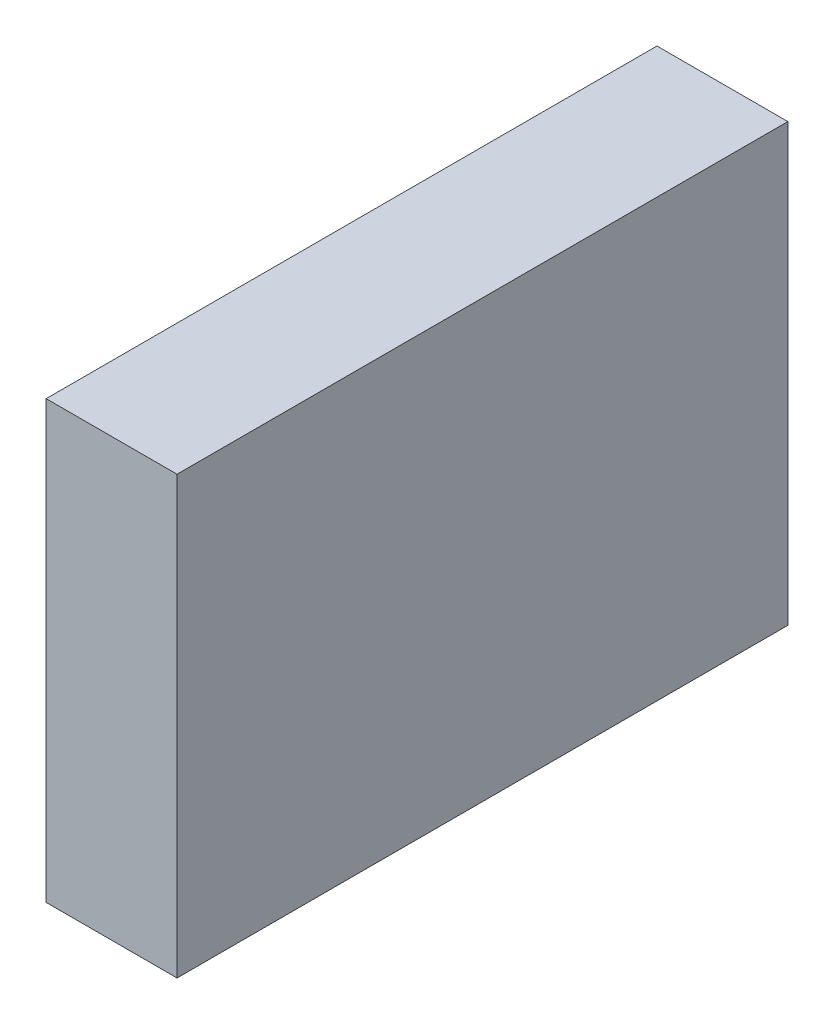
ISO-10303-21;
HEADER;
FILE_DESCRIPTION(('STEP AP214'),'2;1');
FILE_NAME('part.step','',(''),(''),'','','');
FILE_SCHEMA(('AUTOMOTIVE_DESIGN { 1 0 10303 214 1 1 1 1 }'));
ENDSEC;
DATA;
#1=APPLICATION_CONTEXT('core data for automotive mechanical design processes');
#2=APPLICATION_PROTOCOL_DEFINITION('international standard','automotive_design',2000,#1);
#3=PRODUCT_CONTEXT('',#1,'mechanical');
#4=PRODUCT('Part','Part','',(#3));
#5=PRODUCT_RELATED_PRODUCT_CATEGORY('part','',(#4));
#6=PRODUCT_DEFINITION_FORMATION('','',#4);
#7=PRODUCT_DEFINITION_CONTEXT('part definition',#1,'design');
#8=PRODUCT_DEFINITION('design','',#6,#7);
#9=PRODUCT_DEFINITION_SHAPE('','',#8);
#10=(LENGTH_UNIT() NAMED_UNIT(*) SI_UNIT(.MILLI.,.METRE.));
#11=(NAMED_UNIT(*) PLANE_ANGLE_UNIT() SI_UNIT($,.RADIAN.));
#12=(NAMED_UNIT(*) SI_UNIT($,.STERADIAN.) SOLID_ANGLE_UNIT());
#13=UNCERTAINTY_MEASURE_WITH_UNIT(LENGTH_MEASURE(1.E-05),#10,'distance_accuracy_value','');
#14=(GEOMETRIC_REPRESENTATION_CONTEXT(3) GLOBAL_UNCERTAINTY_ASSIGNED_CONTEXT((#13)) GLOBAL_UNIT_ASSIGNED_CONTEXT((#10,
#11,#12)) REPRESENTATION_CONTEXT('',''));
#15=CARTESIAN_POINT('',(0.,0.,0.));
#16=DIRECTION('',(0.,0.,1.));
#17=DIRECTION('',(1.,0.,0.));
#18=AXIS2_PLACEMENT_3D('',#15,#16,#17);
#19=CARTESIAN_POINT('',(3.89999968178111,-1.82000050442942,-3.72112136188661));
#20=DIRECTION('',(1.,-1.74845553146952E-07,0.));
#21=DIRECTION('',(1.74845553146952E-07,1.,-8.74227765734759E-08));
#22=AXIS2_PLACEMENT_3D('',#19,#20,#21);
#23=PLANE('',#22);
#24=DIRECTION('',(0.,8.74227765576152E-08,0.999999999999996));
#25=VECTOR('',#24,1.);
#26=CARTESIAN_POINT('',(3.89999986886585,-0.750000498307826,-3.65112145542898));
#27=LINE('',#26,#25);
#28=CARTESIAN_POINT('',(3.89999986886585,-0.750000498307826,-3.65112145542798));
#29=VERTEX_POINT('',#28);
#30=CARTESIAN_POINT('',(3.89999986886586,-0.750000375916939,-2.25112145542898));
#31=VERTEX_POINT('',#30);
#32=EDGE_CURVE('E11',#29,#31,#27,.T.);
#33=ORIENTED_EDGE('',*,*,#32,.F.);
#34=DIRECTION('',(1.74845553146599E-07,0.999999999999981,-8.74227765732993E-08));
#35=VECTOR('',#34,1.);
#36=CARTESIAN_POINT('',(3.8999996940203,-1.75000049830983,-3.65112136800621));
#37=LINE('',#36,#35);
#38=CARTESIAN_POINT('',(3.8999996940203,-1.75000049830883,-3.65112136800621));
#39=VERTEX_POINT('',#38);
#40=EDGE_CURVE('E59',#39,#29,#37,.T.);
#41=ORIENTED_EDGE('',*,*,#40,.F.);
#42=DIRECTION('',(0.,-8.74227766369169E-08,-0.999999999999996));
#43=VECTOR('',#42,1.);
#44=CARTESIAN_POINT('',(3.89999969402031,-1.75000037591794,-2.25112136800621));
#45=LINE('',#44,#43);
#46=CARTESIAN_POINT('',(3.89999969402031,-1.75000037591794,-2.25112136800721));
#47=VERTEX_POINT('',#46);
#48=EDGE_CURVE('E79',#47,#39,#45,.T.);
#49=ORIENTED_EDGE('',*,*,#48,.F.);
#50=DIRECTION('',(-1.74845553146599E-07,-0.999999999999981,8.74227765732994E-08));
#51=VECTOR('',#50,1.);
#52=CARTESIAN_POINT('',(3.89999986886586,-0.750000375915939,-2.25112145542898));
#53=LINE('',#52,#51);
#54=EDGE_CURVE('E84',#31,#47,#53,.T.);
#55=ORIENTED_EDGE('',*,*,#54,.F.);
#56=EDGE_LOOP('',(#33,#41,#49,#55));
#57=FACE_BOUND('',#56,.T.);
#58=ADVANCED_FACE('F17',(#57),#23,.F.);
#59=CARTESIAN_POINT('',(4.19999968178111,-1.82000055688309,-3.72112136188661));
#60=DIRECTION('',(1.,-1.74845553146952E-07,0.));
#61=DIRECTION('',(1.74845553146952E-07,1.,-8.74227765734759E-08));
#62=AXIS2_PLACEMENT_3D('',#59,#60,#61);
#63=PLANE('',#62);
#64=DIRECTION('',(-1.74845553146599E-07,-0.999999999999981,8.74227765732994E-08));
#65=VECTOR('',#64,1.);
#66=CARTESIAN_POINT('',(4.19999986886586,-0.750000428369605,-2.25112145542898));
#67=LINE('',#66,#65);
#68=CARTESIAN_POINT('',(4.19999986886586,-0.750000428370605,-2.25112145542898));
#69=VERTEX_POINT('',#68);
#70=CARTESIAN_POINT('',(4.19999969402031,-1.75000042837161,-2.2511213680072));
#71=VERTEX_POINT('',#70);
#72=EDGE_CURVE('E24',#69,#71,#67,.T.);
#73=ORIENTED_EDGE('',*,*,#72,.T.);
#74=DIRECTION('',(0.,-8.74227764783136E-08,-0.999999999999996));
#75=VECTOR('',#74,1.);
#76=CARTESIAN_POINT('',(4.19999969402031,-1.75000042837161,-2.2511213680062));
#77=LINE('',#76,#75);
#78=CARTESIAN_POINT('',(4.1999996940203,-1.75000055076249,-3.6511213680062));
#79=VERTEX_POINT('',#78);
#80=EDGE_CURVE('E82',#71,#79,#77,.T.);
#81=ORIENTED_EDGE('',*,*,#80,.T.);
#82=DIRECTION('',(1.74845553146599E-07,0.999999999999981,-8.74227765732993E-08));
#83=VECTOR('',#82,1.);
#84=CARTESIAN_POINT('',(4.1999996940203,-1.75000055076349,-3.6511213680062));
#85=LINE('',#84,#83);
#86=CARTESIAN_POINT('',(4.19999986886585,-0.750000550761492,-3.65112145542798));
#87=VERTEX_POINT('',#86);
#88=EDGE_CURVE('E64',#79,#87,#85,.T.);
#89=ORIENTED_EDGE('',*,*,#88,.T.);
#90=DIRECTION('',(0.,8.74227765576152E-08,0.999999999999996));
#91=VECTOR('',#90,1.);
#92=CARTESIAN_POINT('',(4.19999986886585,-0.750000550761492,-3.65112145542898));
#93=LINE('',#92,#91);
#94=EDGE_CURVE('E61',#87,#69,#93,.T.);
#95=ORIENTED_EDGE('',*,*,#94,.T.);
#96=EDGE_LOOP('',(#73,#81,#89,#95));
#97=FACE_BOUND('',#96,.T.);
#98=ADVANCED_FACE('F62',(#97),#63,.T.);
#99=CARTESIAN_POINT('',(3.89999986886586,-0.750000375915939,-2.25112145542898));
#100=DIRECTION('',(0.,8.74227765734759E-08,1.));
#101=DIRECTION('',(-1.74845553146952E-07,-1.,8.74227765734759E-08));
#102=AXIS2_PLACEMENT_3D('',#99,#100,#101);
#103=PLANE('',#102);
#104=ORIENTED_EDGE('',*,*,#54,.T.);
#105=DIRECTION('',(0.999999999999985,-1.74845552850889E-07,0.));
#106=VECTOR('',#105,1.);
#107=CARTESIAN_POINT('',(3.89999969402031,-1.75000037591794,-2.2511213680062));
#108=LINE('',#107,#106);
#109=EDGE_CURVE('E57',#47,#71,#108,.T.);
#110=ORIENTED_EDGE('',*,*,#109,.T.);
#111=ORIENTED_EDGE('',*,*,#72,.F.);
#112=DIRECTION('',(0.999999999999985,-1.74845553220963E-07,0.));
#113=VECTOR('',#112,1.);
#114=CARTESIAN_POINT('',(3.89999986886586,-0.750000375915939,-2.25112145542898));
#115=LINE('',#114,#113);
#116=EDGE_CURVE('E55',#31,#69,#115,.T.);
#117=ORIENTED_EDGE('',*,*,#116,.F.);
#118=EDGE_LOOP('',(#104,#110,#111,#117));
#119=FACE_BOUND('',#118,.T.);
#120=ADVANCED_FACE('F53',(#119),#103,.T.);
#121=CARTESIAN_POINT('',(3.89999969402031,-1.75000037591794,-2.2511213680062));
#122=DIRECTION('',(-1.74845553146952E-07,-1.,8.74227765734759E-08));
#123=DIRECTION('',(0.,-8.74227765734759E-08,-1.));
#124=AXIS2_PLACEMENT_3D('',#121,#122,#123);
#125=PLANE('',#124);
#126=ORIENTED_EDGE('',*,*,#48,.T.);
#127=DIRECTION('',(0.999999999999985,-1.74845552850889E-07,0.));
#128=VECTOR('',#127,1.);
#129=CARTESIAN_POINT('',(3.8999996940203,-1.75000049830983,-3.65112136800621));
#130=LINE('',#129,#128);
#131=EDGE_CURVE('E68',#39,#79,#130,.T.);
#132=ORIENTED_EDGE('',*,*,#131,.T.);
#133=ORIENTED_EDGE('',*,*,#80,.F.);
#134=ORIENTED_EDGE('',*,*,#109,.F.);
#135=EDGE_LOOP('',(#126,#132,#133,#134));
#136=FACE_BOUND('',#135,.T.);
#137=ADVANCED_FACE('F91',(#136),#125,.T.);
#138=CARTESIAN_POINT('',(3.8999996940203,-1.75000049830983,-3.65112136800621));
#139=DIRECTION('',(0.,-8.74227765734759E-08,-1.));
#140=DIRECTION('',(1.74845553146952E-07,1.,-8.74227765734759E-08));
#141=AXIS2_PLACEMENT_3D('',#138,#139,#140);
#142=PLANE('',#141);
#143=ORIENTED_EDGE('',*,*,#40,.T.);
#144=DIRECTION('',(0.999999999999985,-1.74845553220963E-07,0.));
#145=VECTOR('',#144,1.);
#146=CARTESIAN_POINT('',(3.89999986886585,-0.750000498307826,-3.65112145542898));
#147=LINE('',#146,#145);
#148=EDGE_CURVE('E69',#29,#87,#147,.T.);
#149=ORIENTED_EDGE('',*,*,#148,.T.);
#150=ORIENTED_EDGE('',*,*,#88,.F.);
#151=ORIENTED_EDGE('',*,*,#131,.F.);
#152=EDGE_LOOP('',(#143,#149,#150,#151));
#153=FACE_BOUND('',#152,.T.);
#154=ADVANCED_FACE('F88',(#153),#142,.T.);
#155=CARTESIAN_POINT('',(3.89999986886585,-0.750000498307826,-3.65112145542898));
#156=DIRECTION('',(1.74845553146952E-07,1.,-8.74227765734759E-08));
#157=DIRECTION('',(0.,8.74227765734759E-08,1.));
#158=AXIS2_PLACEMENT_3D('',#155,#156,#157);
#159=PLANE('',#158);
#160=ORIENTED_EDGE('',*,*,#32,.T.);
#161=ORIENTED_EDGE('',*,*,#116,.T.);
#162=ORIENTED_EDGE('',*,*,#94,.F.);
#163=ORIENTED_EDGE('',*,*,#148,.F.);
#164=EDGE_LOOP('',(#160,#161,#162,#163));
#165=FACE_BOUND('',#164,.T.);
#166=ADVANCED_FACE('F71',(#165),#159,.T.);
#167=CLOSED_SHELL('',(#58,#98,#120,#137,#154,#166));
#168=MANIFOLD_SOLID_BREP('B1',#167);
#169=ADVANCED_BREP_SHAPE_REPRESENTATION('',(#18,#168),#14);
#170=SHAPE_DEFINITION_REPRESENTATION(#9,#169);
ENDSEC;
END-ISO-10303-21;
